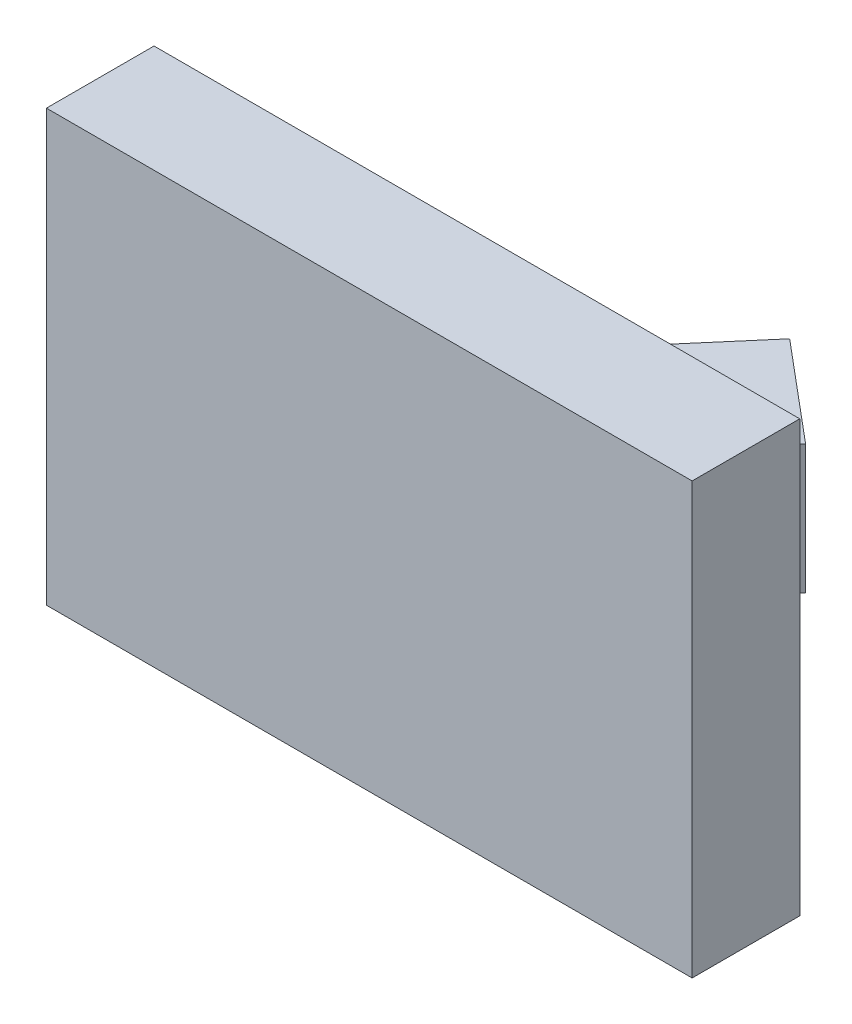
ISO-10303-21;
HEADER;
FILE_DESCRIPTION(('STEP AP214'),'2;1');
FILE_NAME('part.step','',(''),(''),'','','');
FILE_SCHEMA(('AUTOMOTIVE_DESIGN { 1 0 10303 214 1 1 1 1 }'));
ENDSEC;
DATA;
#1=APPLICATION_CONTEXT('core data for automotive mechanical design processes');
#2=APPLICATION_PROTOCOL_DEFINITION('international standard','automotive_design',2000,#1);
#3=PRODUCT_CONTEXT('',#1,'mechanical');
#4=PRODUCT('Part','Part','',(#3));
#5=PRODUCT_RELATED_PRODUCT_CATEGORY('part','',(#4));
#6=PRODUCT_DEFINITION_FORMATION('','',#4);
#7=PRODUCT_DEFINITION_CONTEXT('part definition',#1,'design');
#8=PRODUCT_DEFINITION('design','',#6,#7);
#9=PRODUCT_DEFINITION_SHAPE('','',#8);
#10=(LENGTH_UNIT() NAMED_UNIT(*) SI_UNIT(.MILLI.,.METRE.));
#11=(NAMED_UNIT(*) PLANE_ANGLE_UNIT() SI_UNIT($,.RADIAN.));
#12=(NAMED_UNIT(*) SI_UNIT($,.STERADIAN.) SOLID_ANGLE_UNIT());
#13=UNCERTAINTY_MEASURE_WITH_UNIT(LENGTH_MEASURE(1.E-05),#10,'distance_accuracy_value','');
#14=(GEOMETRIC_REPRESENTATION_CONTEXT(3) GLOBAL_UNCERTAINTY_ASSIGNED_CONTEXT((#13)) GLOBAL_UNIT_ASSIGNED_CONTEXT((#10,
#11,#12)) REPRESENTATION_CONTEXT('',''));
#15=CARTESIAN_POINT('',(0.,0.,0.));
#16=DIRECTION('',(0.,0.,1.));
#17=DIRECTION('',(1.,0.,0.));
#18=AXIS2_PLACEMENT_3D('',#15,#16,#17);
#19=CARTESIAN_POINT('',(-15.,9.99999999999999,5.));
#20=DIRECTION('',(1.,0.,0.));
#21=DIRECTION('',(0.,1.,0.));
#22=AXIS2_PLACEMENT_3D('',#19,#20,#21);
#23=PLANE('',#22);
#24=DIRECTION('',(0.,-1.,0.));
#25=VECTOR('',#24,1.);
#26=CARTESIAN_POINT('',(-15.,9.99999999999999,0.));
#27=LINE('',#26,#25);
#28=CARTESIAN_POINT('',(-15.,9.99999999999999,0.));
#29=VERTEX_POINT('',#28);
#30=CARTESIAN_POINT('',(-15.,-10.,0.));
#31=VERTEX_POINT('',#30);
#32=EDGE_CURVE('E207',#29,#31,#27,.T.);
#33=ORIENTED_EDGE('',*,*,#32,.T.);
#34=DIRECTION('',(0.,0.,-1.));
#35=VECTOR('',#34,1.);
#36=CARTESIAN_POINT('',(-15.,-10.,5.));
#37=LINE('',#36,#35);
#38=CARTESIAN_POINT('',(-15.,-10.,5.));
#39=VERTEX_POINT('',#38);
#40=EDGE_CURVE('E12',#39,#31,#37,.T.);
#41=ORIENTED_EDGE('',*,*,#40,.F.);
#42=DIRECTION('',(0.,-1.,0.));
#43=VECTOR('',#42,1.);
#44=CARTESIAN_POINT('',(-15.,9.99999999999999,5.));
#45=LINE('',#44,#43);
#46=CARTESIAN_POINT('',(-15.,9.99999999999999,5.));
#47=VERTEX_POINT('',#46);
#48=EDGE_CURVE('E210',#47,#39,#45,.T.);
#49=ORIENTED_EDGE('',*,*,#48,.F.);
#50=DIRECTION('',(0.,0.,-1.));
#51=VECTOR('',#50,1.);
#52=CARTESIAN_POINT('',(-15.,9.99999999999999,5.));
#53=LINE('',#52,#51);
#54=EDGE_CURVE('E116',#47,#29,#53,.T.);
#55=ORIENTED_EDGE('',*,*,#54,.T.);
#56=EDGE_LOOP('',(#33,#41,#49,#55));
#57=FACE_BOUND('',#56,.T.);
#58=ADVANCED_FACE('F93',(#57),#23,.F.);
#59=CARTESIAN_POINT('',(-15.,-10.,5.));
#60=DIRECTION('',(0.,1.,0.));
#61=DIRECTION('',(0.,0.,1.));
#62=AXIS2_PLACEMENT_3D('',#59,#60,#61);
#63=PLANE('',#62);
#64=DIRECTION('',(1.,0.,0.));
#65=VECTOR('',#64,1.);
#66=CARTESIAN_POINT('',(-15.,-10.,0.));
#67=LINE('',#66,#65);
#68=CARTESIAN_POINT('',(15.,-10.,0.));
#69=VERTEX_POINT('',#68);
#70=EDGE_CURVE('E220',#31,#69,#67,.T.);
#71=ORIENTED_EDGE('',*,*,#70,.T.);
#72=DIRECTION('',(0.,0.,-1.));
#73=VECTOR('',#72,1.);
#74=CARTESIAN_POINT('',(15.,-10.,5.));
#75=LINE('',#74,#73);
#76=CARTESIAN_POINT('',(15.,-10.,5.));
#77=VERTEX_POINT('',#76);
#78=EDGE_CURVE('E100',#77,#69,#75,.T.);
#79=ORIENTED_EDGE('',*,*,#78,.F.);
#80=DIRECTION('',(1.,0.,0.));
#81=VECTOR('',#80,1.);
#82=CARTESIAN_POINT('',(-15.,-10.,5.));
#83=LINE('',#82,#81);
#84=EDGE_CURVE('E142',#39,#77,#83,.T.);
#85=ORIENTED_EDGE('',*,*,#84,.F.);
#86=ORIENTED_EDGE('',*,*,#40,.T.);
#87=EDGE_LOOP('',(#71,#79,#85,#86));
#88=FACE_BOUND('',#87,.T.);
#89=ADVANCED_FACE('F234',(#88),#63,.F.);
#90=CARTESIAN_POINT('',(15.,9.99999999999999,5.));
#91=DIRECTION('',(1.,0.,0.));
#92=DIRECTION('',(0.,1.,0.));
#93=AXIS2_PLACEMENT_3D('',#90,#91,#92);
#94=PLANE('',#93);
#95=DIRECTION('',(0.,-1.,0.));
#96=VECTOR('',#95,1.);
#97=CARTESIAN_POINT('',(15.,9.99999999999999,0.));
#98=LINE('',#97,#96);
#99=CARTESIAN_POINT('',(15.,9.99999999999999,0.));
#100=VERTEX_POINT('',#99);
#101=EDGE_CURVE('E223',#100,#69,#98,.T.);
#102=ORIENTED_EDGE('',*,*,#101,.F.);
#103=DIRECTION('',(0.,0.,-1.));
#104=VECTOR('',#103,1.);
#105=CARTESIAN_POINT('',(15.,9.99999999999999,5.));
#106=LINE('',#105,#104);
#107=CARTESIAN_POINT('',(15.,9.99999999999999,5.));
#108=VERTEX_POINT('',#107);
#109=EDGE_CURVE('E229',#108,#100,#106,.T.);
#110=ORIENTED_EDGE('',*,*,#109,.F.);
#111=DIRECTION('',(0.,-1.,0.));
#112=VECTOR('',#111,1.);
#113=CARTESIAN_POINT('',(15.,9.99999999999999,5.));
#114=LINE('',#113,#112);
#115=EDGE_CURVE('E214',#108,#77,#114,.T.);
#116=ORIENTED_EDGE('',*,*,#115,.T.);
#117=ORIENTED_EDGE('',*,*,#78,.T.);
#118=EDGE_LOOP('',(#102,#110,#116,#117));
#119=FACE_BOUND('',#118,.T.);
#120=ADVANCED_FACE('F232',(#119),#94,.T.);
#121=CARTESIAN_POINT('',(-15.,9.99999999999999,5.));
#122=DIRECTION('',(0.,1.,0.));
#123=DIRECTION('',(0.,0.,1.));
#124=AXIS2_PLACEMENT_3D('',#121,#122,#123);
#125=PLANE('',#124);
#126=DIRECTION('',(1.,0.,0.));
#127=VECTOR('',#126,1.);
#128=CARTESIAN_POINT('',(-15.,9.99999999999999,0.));
#129=LINE('',#128,#127);
#130=EDGE_CURVE('E212',#29,#100,#129,.T.);
#131=ORIENTED_EDGE('',*,*,#130,.F.);
#132=ORIENTED_EDGE('',*,*,#54,.F.);
#133=DIRECTION('',(1.,0.,0.));
#134=VECTOR('',#133,1.);
#135=CARTESIAN_POINT('',(-15.,9.99999999999999,5.));
#136=LINE('',#135,#134);
#137=EDGE_CURVE('E217',#47,#108,#136,.T.);
#138=ORIENTED_EDGE('',*,*,#137,.T.);
#139=ORIENTED_EDGE('',*,*,#109,.T.);
#140=EDGE_LOOP('',(#131,#132,#138,#139));
#141=FACE_BOUND('',#140,.T.);
#142=ADVANCED_FACE('F236',(#141),#125,.T.);
#143=CARTESIAN_POINT('',(0.,0.,5.));
#144=DIRECTION('',(0.,0.,1.));
#145=DIRECTION('',(1.,0.,0.));
#146=AXIS2_PLACEMENT_3D('',#143,#144,#145);
#147=PLANE('',#146);
#148=ORIENTED_EDGE('',*,*,#48,.T.);
#149=ORIENTED_EDGE('',*,*,#84,.T.);
#150=ORIENTED_EDGE('',*,*,#115,.F.);
#151=ORIENTED_EDGE('',*,*,#137,.F.);
#152=EDGE_LOOP('',(#148,#149,#150,#151));
#153=FACE_BOUND('',#152,.T.);
#154=ADVANCED_FACE('F239',(#153),#147,.T.);
#155=CARTESIAN_POINT('',(0.,0.,0.));
#156=DIRECTION('',(0.,0.,1.));
#157=DIRECTION('',(1.,0.,0.));
#158=AXIS2_PLACEMENT_3D('',#155,#156,#157);
#159=PLANE('',#158);
#160=DIRECTION('',(1.,0.,0.));
#161=VECTOR('',#160,1.);
#162=CARTESIAN_POINT('',(0.,-3.,0.));
#163=LINE('',#162,#161);
#164=CARTESIAN_POINT('',(-4.,-3.,0.));
#165=VERTEX_POINT('',#164);
#166=CARTESIAN_POINT('',(4.,-3.,0.));
#167=VERTEX_POINT('',#166);
#168=EDGE_CURVE('E175',#165,#167,#163,.T.);
#169=ORIENTED_EDGE('',*,*,#168,.T.);
#170=DIRECTION('',(0.,1.,0.));
#171=VECTOR('',#170,1.);
#172=CARTESIAN_POINT('',(4.,-3.,0.));
#173=LINE('',#172,#171);
#174=CARTESIAN_POINT('',(4.,3.,0.));
#175=VERTEX_POINT('',#174);
#176=EDGE_CURVE('E205',#167,#175,#173,.T.);
#177=ORIENTED_EDGE('',*,*,#176,.T.);
#178=DIRECTION('',(1.,0.,0.));
#179=VECTOR('',#178,1.);
#180=CARTESIAN_POINT('',(0.,3.,0.));
#181=LINE('',#180,#179);
#182=CARTESIAN_POINT('',(-4.,3.,0.));
#183=VERTEX_POINT('',#182);
#184=EDGE_CURVE('E186',#183,#175,#181,.T.);
#185=ORIENTED_EDGE('',*,*,#184,.F.);
#186=DIRECTION('',(0.,-1.,0.));
#187=VECTOR('',#186,1.);
#188=CARTESIAN_POINT('',(-4.,3.,0.));
#189=LINE('',#188,#187);
#190=EDGE_CURVE('E171',#183,#165,#189,.T.);
#191=ORIENTED_EDGE('',*,*,#190,.T.);
#192=EDGE_LOOP('',(#169,#177,#185,#191));
#193=FACE_BOUND('',#192,.T.);
#194=ORIENTED_EDGE('',*,*,#32,.F.);
#195=ORIENTED_EDGE('',*,*,#130,.T.);
#196=ORIENTED_EDGE('',*,*,#101,.T.);
#197=ORIENTED_EDGE('',*,*,#70,.F.);
#198=EDGE_LOOP('',(#194,#195,#196,#197));
#199=FACE_BOUND('',#198,.T.);
#200=ADVANCED_FACE('F184',(#193,#199),#159,.F.);
#201=CARTESIAN_POINT('',(0.,3.,0.));
#202=DIRECTION('',(0.,1.,0.));
#203=DIRECTION('',(0.,0.,1.));
#204=AXIS2_PLACEMENT_3D('',#201,#202,#203);
#205=PLANE('',#204);
#206=DIRECTION('',(0.642787609686538,0.,-0.766044443118979));
#207=VECTOR('',#206,1.);
#208=CARTESIAN_POINT('',(2.34729635533387,3.,1.96961550602441));
#209=LINE('',#208,#207);
#210=CARTESIAN_POINT('',(9.1423008774923,3.,-6.12835554495183));
#211=VERTEX_POINT('',#210);
#212=EDGE_CURVE('E187',#175,#211,#209,.T.);
#213=ORIENTED_EDGE('',*,*,#212,.T.);
#214=DIRECTION('',(-0.766044443118979,0.,-0.642787609686538));
#215=VECTOR('',#214,1.);
#216=CARTESIAN_POINT('',(6.79500452215844,3.,-8.09797105097625));
#217=LINE('',#216,#215);
#218=CARTESIAN_POINT('',(4.54603421877843,3.,-9.98508120307106));
#219=VERTEX_POINT('',#218);
#220=EDGE_CURVE('E191',#211,#219,#217,.T.);
#221=ORIENTED_EDGE('',*,*,#220,.T.);
#222=DIRECTION('',(0.65023824518055,0.,-0.759730363026593));
#223=VECTOR('',#222,1.);
#224=CARTESIAN_POINT('',(-2.30876089801808,3.,-1.97602295225918));
#225=LINE('',#224,#223);
#226=EDGE_CURVE('E200',#183,#219,#225,.T.);
#227=ORIENTED_EDGE('',*,*,#226,.F.);
#228=ORIENTED_EDGE('',*,*,#184,.T.);
#229=EDGE_LOOP('',(#213,#221,#227,#228));
#230=FACE_BOUND('',#229,.T.);
#231=ADVANCED_FACE('F253',(#230),#205,.T.);
#232=CARTESIAN_POINT('',(2.34729635533387,-3.,1.96961550602441));
#233=DIRECTION('',(0.766044443118979,0.,0.642787609686538));
#234=DIRECTION('',(0.642787609686538,0.,-0.766044443118979));
#235=AXIS2_PLACEMENT_3D('',#232,#233,#234);
#236=PLANE('',#235);
#237=DIRECTION('',(0.,1.,0.));
#238=VECTOR('',#237,1.);
#239=CARTESIAN_POINT('',(9.1423008774923,-3.,-6.12835554495183));
#240=LINE('',#239,#238);
#241=CARTESIAN_POINT('',(9.1423008774923,-3.,-6.12835554495183));
#242=VERTEX_POINT('',#241);
#243=EDGE_CURVE('E182',#242,#211,#240,.T.);
#244=ORIENTED_EDGE('',*,*,#243,.T.);
#245=ORIENTED_EDGE('',*,*,#212,.F.);
#246=ORIENTED_EDGE('',*,*,#176,.F.);
#247=DIRECTION('',(0.642787609686538,0.,-0.766044443118979));
#248=VECTOR('',#247,1.);
#249=CARTESIAN_POINT('',(2.34729635533387,-3.,1.96961550602441));
#250=LINE('',#249,#248);
#251=EDGE_CURVE('E107',#167,#242,#250,.T.);
#252=ORIENTED_EDGE('',*,*,#251,.T.);
#253=EDGE_LOOP('',(#244,#245,#246,#252));
#254=FACE_BOUND('',#253,.T.);
#255=ADVANCED_FACE('F256',(#254),#236,.T.);
#256=CARTESIAN_POINT('',(-2.30876089801808,-3.,-1.97602295225918));
#257=DIRECTION('',(0.759730363026593,0.,0.65023824518055));
#258=DIRECTION('',(0.65023824518055,0.,-0.759730363026593));
#259=AXIS2_PLACEMENT_3D('',#256,#257,#258);
#260=PLANE('',#259);
#261=DIRECTION('',(0.65023824518055,0.,-0.759730363026593));
#262=VECTOR('',#261,1.);
#263=CARTESIAN_POINT('',(-2.30876089801808,-3.,-1.97602295225918));
#264=LINE('',#263,#262);
#265=CARTESIAN_POINT('',(4.54603421877843,-3.,-9.98508120307106));
#266=VERTEX_POINT('',#265);
#267=EDGE_CURVE('E167',#165,#266,#264,.T.);
#268=ORIENTED_EDGE('',*,*,#267,.F.);
#269=ORIENTED_EDGE('',*,*,#190,.F.);
#270=ORIENTED_EDGE('',*,*,#226,.T.);
#271=DIRECTION('',(0.,1.,0.));
#272=VECTOR('',#271,1.);
#273=CARTESIAN_POINT('',(4.54603421877843,-3.,-9.98508120307106));
#274=LINE('',#273,#272);
#275=EDGE_CURVE('E173',#266,#219,#274,.T.);
#276=ORIENTED_EDGE('',*,*,#275,.F.);
#277=EDGE_LOOP('',(#268,#269,#270,#276));
#278=FACE_BOUND('',#277,.T.);
#279=ADVANCED_FACE('F168',(#278),#260,.F.);
#280=CARTESIAN_POINT('',(6.79500452215844,-3.,-8.09797105097625));
#281=DIRECTION('',(0.642787609686538,0.,-0.766044443118979));
#282=DIRECTION('',(-0.766044443118979,0.,-0.642787609686538));
#283=AXIS2_PLACEMENT_3D('',#280,#281,#282);
#284=PLANE('',#283);
#285=CARTESIAN_POINT('',(6.79500452215844,0.,-8.09797105097625));
#286=DIRECTION('',(0.642787609686538,0.,-0.766044443118979));
#287=DIRECTION('',(-0.766044443118979,0.,-0.642787609686538));
#288=AXIS2_PLACEMENT_3D('',#285,#286,#287);
#289=CIRCLE('',#288,2.1);
#290=CARTESIAN_POINT('',(5.18631119160859,0.,-9.44782503131798));
#291=VERTEX_POINT('',#290);
#292=EDGE_CURVE('E194',#291,#291,#289,.T.);
#293=ORIENTED_EDGE('',*,*,#292,.F.);
#294=EDGE_LOOP('',(#293));
#295=FACE_BOUND('',#294,.T.);
#296=ORIENTED_EDGE('',*,*,#275,.T.);
#297=ORIENTED_EDGE('',*,*,#220,.F.);
#298=ORIENTED_EDGE('',*,*,#243,.F.);
#299=DIRECTION('',(-0.766044443118979,0.,-0.642787609686538));
#300=VECTOR('',#299,1.);
#301=CARTESIAN_POINT('',(6.79500452215844,-3.,-8.09797105097625));
#302=LINE('',#301,#300);
#303=EDGE_CURVE('E176',#242,#266,#302,.T.);
#304=ORIENTED_EDGE('',*,*,#303,.T.);
#305=EDGE_LOOP('',(#296,#297,#298,#304));
#306=FACE_BOUND('',#305,.T.);
#307=ADVANCED_FACE('F260',(#295,#306),#284,.T.);
#308=CARTESIAN_POINT('',(0.,-3.,0.));
#309=DIRECTION('',(0.,1.,0.));
#310=DIRECTION('',(0.,0.,1.));
#311=AXIS2_PLACEMENT_3D('',#308,#309,#310);
#312=PLANE('',#311);
#313=ORIENTED_EDGE('',*,*,#251,.F.);
#314=ORIENTED_EDGE('',*,*,#168,.F.);
#315=ORIENTED_EDGE('',*,*,#267,.T.);
#316=ORIENTED_EDGE('',*,*,#303,.F.);
#317=EDGE_LOOP('',(#313,#314,#315,#316));
#318=FACE_BOUND('',#317,.T.);
#319=ADVANCED_FACE('F179',(#318),#312,.F.);
#320=CARTESIAN_POINT('',(2.29549125435268,0.,-2.7356599491434));
#321=DIRECTION('',(0.642787609686538,0.,-0.766044443118979));
#322=DIRECTION('',(-0.766044443118979,0.,-0.642787609686538));
#323=AXIS2_PLACEMENT_3D('',#320,#321,#322);
#324=CYLINDRICAL_SURFACE('',#323,2.1);
#325=CARTESIAN_POINT('',(2.29549125435268,0.,-2.7356599491434));
#326=DIRECTION('',(0.642787609686538,0.,-0.766044443118979));
#327=DIRECTION('',(-0.766044443118979,0.,-0.642787609686538));
#328=AXIS2_PLACEMENT_3D('',#325,#326,#327);
#329=CIRCLE('',#328,2.1);
#330=CARTESIAN_POINT('',(0.686797923802823,0.,-4.08551392948513));
#331=VERTEX_POINT('',#330);
#332=EDGE_CURVE('E188',#331,#331,#329,.T.);
#333=ORIENTED_EDGE('',*,*,#332,.F.);
#334=EDGE_LOOP('',(#333));
#335=FACE_BOUND('',#334,.T.);
#336=ORIENTED_EDGE('',*,*,#292,.T.);
#337=EDGE_LOOP('',(#336));
#338=FACE_BOUND('',#337,.T.);
#339=ADVANCED_FACE('F268',(#335,#338),#324,.F.);
#340=CARTESIAN_POINT('',(2.29549125435268,0.,-2.7356599491434));
#341=DIRECTION('',(0.642787609686538,0.,-0.766044443118979));
#342=DIRECTION('',(-0.766044443118979,0.,-0.642787609686538));
#343=AXIS2_PLACEMENT_3D('',#340,#341,#342);
#344=PLANE('',#343);
#345=ORIENTED_EDGE('',*,*,#332,.T.);
#346=EDGE_LOOP('',(#345));
#347=FACE_BOUND('',#346,.T.);
#348=ADVANCED_FACE('F274',(#347),#344,.T.);
#349=CLOSED_SHELL('',(#58,#89,#120,#142,#154,#200,#231,#255,#279,#307,#319,#339,#348));
#350=MANIFOLD_SOLID_BREP('B2',#349);
#351=ADVANCED_BREP_SHAPE_REPRESENTATION('',(#18,#350),#14);
#352=SHAPE_DEFINITION_REPRESENTATION(#9,#351);
ENDSEC;
END-ISO-10303-21;
